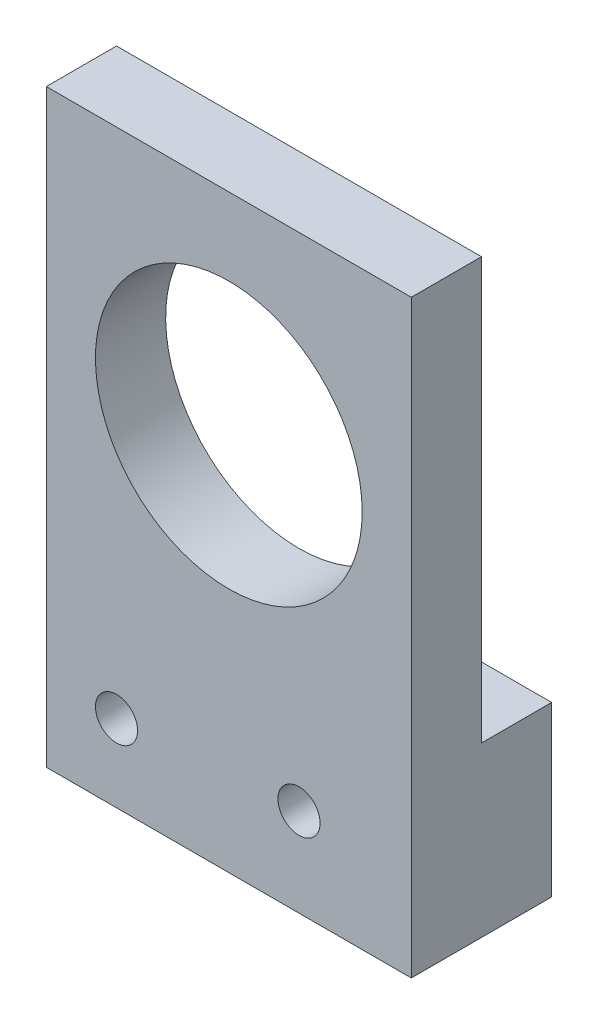
ISO-10303-21;
HEADER;
FILE_DESCRIPTION(('STEP AP214'),'2;1');
FILE_NAME('part.step','',(''),(''),'','','');
FILE_SCHEMA(('AUTOMOTIVE_DESIGN { 1 0 10303 214 1 1 1 1 }'));
ENDSEC;
DATA;
#1=APPLICATION_CONTEXT('core data for automotive mechanical design processes');
#2=APPLICATION_PROTOCOL_DEFINITION('international standard','automotive_design',2000,#1);
#3=PRODUCT_CONTEXT('',#1,'mechanical');
#4=PRODUCT('Part','Part','',(#3));
#5=PRODUCT_RELATED_PRODUCT_CATEGORY('part','',(#4));
#6=PRODUCT_DEFINITION_FORMATION('','',#4);
#7=PRODUCT_DEFINITION_CONTEXT('part definition',#1,'design');
#8=PRODUCT_DEFINITION('design','',#6,#7);
#9=PRODUCT_DEFINITION_SHAPE('','',#8);
#10=(LENGTH_UNIT() NAMED_UNIT(*) SI_UNIT(.MILLI.,.METRE.));
#11=(NAMED_UNIT(*) PLANE_ANGLE_UNIT() SI_UNIT($,.RADIAN.));
#12=(NAMED_UNIT(*) SI_UNIT($,.STERADIAN.) SOLID_ANGLE_UNIT());
#13=UNCERTAINTY_MEASURE_WITH_UNIT(LENGTH_MEASURE(1.E-05),#10,'distance_accuracy_value','');
#14=(GEOMETRIC_REPRESENTATION_CONTEXT(3) GLOBAL_UNCERTAINTY_ASSIGNED_CONTEXT((#13)) GLOBAL_UNIT_ASSIGNED_CONTEXT((#10,
#11,#12)) REPRESENTATION_CONTEXT('',''));
#15=CARTESIAN_POINT('',(0.,0.,0.));
#16=DIRECTION('',(0.,0.,1.));
#17=DIRECTION('',(1.,0.,0.));
#18=AXIS2_PLACEMENT_3D('',#15,#16,#17);
#19=CARTESIAN_POINT('',(0.,0.,10.));
#20=DIRECTION('',(0.,0.,-1.));
#21=DIRECTION('',(-1.,0.,0.));
#22=AXIS2_PLACEMENT_3D('',#19,#20,#21);
#23=PLANE('',#22);
#24=DIRECTION('',(1.,0.,0.));
#25=VECTOR('',#24,1.);
#26=CARTESIAN_POINT('',(13.,-27.,10.));
#27=LINE('',#26,#25);
#28=CARTESIAN_POINT('',(-13.,-27.,10.));
#29=VERTEX_POINT('',#28);
#30=CARTESIAN_POINT('',(13.,-27.,10.));
#31=VERTEX_POINT('',#30);
#32=EDGE_CURVE('E135',#29,#31,#27,.T.);
#33=ORIENTED_EDGE('',*,*,#32,.T.);
#34=DIRECTION('',(0.,1.,0.));
#35=VECTOR('',#34,1.);
#36=CARTESIAN_POINT('',(13.,15.,10.));
#37=LINE('',#36,#35);
#38=CARTESIAN_POINT('',(13.,15.,10.));
#39=VERTEX_POINT('',#38);
#40=EDGE_CURVE('E79',#31,#39,#37,.T.);
#41=ORIENTED_EDGE('',*,*,#40,.T.);
#42=DIRECTION('',(-1.,0.,0.));
#43=VECTOR('',#42,1.);
#44=CARTESIAN_POINT('',(-13.,15.,10.));
#45=LINE('',#44,#43);
#46=CARTESIAN_POINT('',(-13.,15.,10.));
#47=VERTEX_POINT('',#46);
#48=EDGE_CURVE('E138',#39,#47,#45,.T.);
#49=ORIENTED_EDGE('',*,*,#48,.T.);
#50=DIRECTION('',(0.,-1.,0.));
#51=VECTOR('',#50,1.);
#52=CARTESIAN_POINT('',(-13.,-27.,10.));
#53=LINE('',#52,#51);
#54=EDGE_CURVE('E58',#47,#29,#53,.T.);
#55=ORIENTED_EDGE('',*,*,#54,.T.);
#56=EDGE_LOOP('',(#33,#41,#49,#55));
#57=FACE_BOUND('',#56,.T.);
#58=CARTESIAN_POINT('',(0.,0.,10.));
#59=DIRECTION('',(0.,0.,1.));
#60=DIRECTION('',(1.,0.,0.));
#61=AXIS2_PLACEMENT_3D('',#58,#59,#60);
#62=CIRCLE('',#61,9.5);
#63=CARTESIAN_POINT('',(9.5,0.,10.));
#64=VERTEX_POINT('',#63);
#65=EDGE_CURVE('E129',#64,#64,#62,.T.);
#66=ORIENTED_EDGE('',*,*,#65,.F.);
#67=EDGE_LOOP('',(#66));
#68=FACE_BOUND('',#67,.T.);
#69=CARTESIAN_POINT('',(-8.,-21.5,10.));
#70=DIRECTION('',(0.,0.,1.));
#71=DIRECTION('',(1.,0.,0.));
#72=AXIS2_PLACEMENT_3D('',#69,#70,#71);
#73=CIRCLE('',#72,1.5);
#74=CARTESIAN_POINT('',(-6.5,-21.5,10.));
#75=VERTEX_POINT('',#74);
#76=EDGE_CURVE('E126',#75,#75,#73,.T.);
#77=ORIENTED_EDGE('',*,*,#76,.F.);
#78=EDGE_LOOP('',(#77));
#79=FACE_BOUND('',#78,.T.);
#80=CARTESIAN_POINT('',(5.,-20.7,10.));
#81=DIRECTION('',(0.,0.,1.));
#82=DIRECTION('',(-1.,0.,0.));
#83=AXIS2_PLACEMENT_3D('',#80,#81,#82);
#84=CIRCLE('',#83,1.5);
#85=CARTESIAN_POINT('',(3.5,-20.7,10.));
#86=VERTEX_POINT('',#85);
#87=EDGE_CURVE('E120',#86,#86,#84,.T.);
#88=ORIENTED_EDGE('',*,*,#87,.F.);
#89=EDGE_LOOP('',(#88));
#90=FACE_BOUND('',#89,.T.);
#91=ADVANCED_FACE('F33',(#57,#68,#79,#90),#23,.F.);
#92=CARTESIAN_POINT('',(0.,0.,0.));
#93=DIRECTION('',(0.,0.,-1.));
#94=DIRECTION('',(-1.,0.,0.));
#95=AXIS2_PLACEMENT_3D('',#92,#93,#94);
#96=PLANE('',#95);
#97=DIRECTION('',(-1.,0.,0.));
#98=VECTOR('',#97,1.);
#99=CARTESIAN_POINT('',(27.,-15.,0.));
#100=LINE('',#99,#98);
#101=CARTESIAN_POINT('',(13.,-15.,0.));
#102=VERTEX_POINT('',#101);
#103=CARTESIAN_POINT('',(-13.,-15.,0.));
#104=VERTEX_POINT('',#103);
#105=EDGE_CURVE('E49',#102,#104,#100,.T.);
#106=ORIENTED_EDGE('',*,*,#105,.F.);
#107=DIRECTION('',(0.,1.,0.));
#108=VECTOR('',#107,1.);
#109=CARTESIAN_POINT('',(13.,15.,0.));
#110=LINE('',#109,#108);
#111=CARTESIAN_POINT('',(13.,-27.,0.));
#112=VERTEX_POINT('',#111);
#113=EDGE_CURVE('E144',#112,#102,#110,.T.);
#114=ORIENTED_EDGE('',*,*,#113,.F.);
#115=DIRECTION('',(1.,0.,0.));
#116=VECTOR('',#115,1.);
#117=CARTESIAN_POINT('',(13.,-27.,0.));
#118=LINE('',#117,#116);
#119=CARTESIAN_POINT('',(-13.,-27.,0.));
#120=VERTEX_POINT('',#119);
#121=EDGE_CURVE('E134',#120,#112,#118,.T.);
#122=ORIENTED_EDGE('',*,*,#121,.F.);
#123=DIRECTION('',(0.,-1.,0.));
#124=VECTOR('',#123,1.);
#125=CARTESIAN_POINT('',(-13.,-27.,0.));
#126=LINE('',#125,#124);
#127=EDGE_CURVE('E72',#104,#120,#126,.T.);
#128=ORIENTED_EDGE('',*,*,#127,.F.);
#129=EDGE_LOOP('',(#106,#114,#122,#128));
#130=FACE_BOUND('',#129,.T.);
#131=CARTESIAN_POINT('',(-8.,-21.5,0.));
#132=DIRECTION('',(0.,0.,1.));
#133=DIRECTION('',(1.,0.,0.));
#134=AXIS2_PLACEMENT_3D('',#131,#132,#133);
#135=CIRCLE('',#134,1.5);
#136=CARTESIAN_POINT('',(-6.5,-21.5,0.));
#137=VERTEX_POINT('',#136);
#138=EDGE_CURVE('E123',#137,#137,#135,.T.);
#139=ORIENTED_EDGE('',*,*,#138,.T.);
#140=EDGE_LOOP('',(#139));
#141=FACE_BOUND('',#140,.T.);
#142=CARTESIAN_POINT('',(5.,-20.7,0.));
#143=DIRECTION('',(0.,0.,1.));
#144=DIRECTION('',(-1.,0.,0.));
#145=AXIS2_PLACEMENT_3D('',#142,#143,#144);
#146=CIRCLE('',#145,1.5);
#147=CARTESIAN_POINT('',(3.5,-20.7,0.));
#148=VERTEX_POINT('',#147);
#149=EDGE_CURVE('E119',#148,#148,#146,.T.);
#150=ORIENTED_EDGE('',*,*,#149,.T.);
#151=EDGE_LOOP('',(#150));
#152=FACE_BOUND('',#151,.T.);
#153=ADVANCED_FACE('F156',(#130,#141,#152),#96,.T.);
#154=CARTESIAN_POINT('',(13.,-27.,10.));
#155=DIRECTION('',(0.,1.,0.));
#156=DIRECTION('',(-1.,0.,0.));
#157=AXIS2_PLACEMENT_3D('',#154,#155,#156);
#158=PLANE('',#157);
#159=ORIENTED_EDGE('',*,*,#121,.T.);
#160=DIRECTION('',(0.,0.,-1.));
#161=VECTOR('',#160,1.);
#162=CARTESIAN_POINT('',(13.,-27.,10.));
#163=LINE('',#162,#161);
#164=EDGE_CURVE('E11',#31,#112,#163,.T.);
#165=ORIENTED_EDGE('',*,*,#164,.F.);
#166=ORIENTED_EDGE('',*,*,#32,.F.);
#167=DIRECTION('',(0.,0.,-1.));
#168=VECTOR('',#167,1.);
#169=CARTESIAN_POINT('',(-13.,-27.,10.));
#170=LINE('',#169,#168);
#171=EDGE_CURVE('E141',#29,#120,#170,.T.);
#172=ORIENTED_EDGE('',*,*,#171,.T.);
#173=EDGE_LOOP('',(#159,#165,#166,#172));
#174=FACE_BOUND('',#173,.T.);
#175=ADVANCED_FACE('F35',(#174),#158,.F.);
#176=CARTESIAN_POINT('',(13.,15.,10.));
#177=DIRECTION('',(-1.,0.,0.));
#178=DIRECTION('',(0.,-1.,0.));
#179=AXIS2_PLACEMENT_3D('',#176,#177,#178);
#180=PLANE('',#179);
#181=DIRECTION('',(0.,0.,1.));
#182=VECTOR('',#181,1.);
#183=CARTESIAN_POINT('',(13.,-15.,10.));
#184=LINE('',#183,#182);
#185=CARTESIAN_POINT('',(13.,-15.,5.));
#186=VERTEX_POINT('',#185);
#187=EDGE_CURVE('E117',#102,#186,#184,.T.);
#188=ORIENTED_EDGE('',*,*,#187,.T.);
#189=DIRECTION('',(0.,1.,0.));
#190=VECTOR('',#189,1.);
#191=CARTESIAN_POINT('',(13.,15.,5.));
#192=LINE('',#191,#190);
#193=CARTESIAN_POINT('',(13.,15.,5.));
#194=VERTEX_POINT('',#193);
#195=EDGE_CURVE('E101',#186,#194,#192,.T.);
#196=ORIENTED_EDGE('',*,*,#195,.T.);
#197=DIRECTION('',(0.,0.,-1.));
#198=VECTOR('',#197,1.);
#199=CARTESIAN_POINT('',(13.,15.,10.));
#200=LINE('',#199,#198);
#201=EDGE_CURVE('E42',#39,#194,#200,.T.);
#202=ORIENTED_EDGE('',*,*,#201,.F.);
#203=ORIENTED_EDGE('',*,*,#40,.F.);
#204=ORIENTED_EDGE('',*,*,#164,.T.);
#205=ORIENTED_EDGE('',*,*,#113,.T.);
#206=EDGE_LOOP('',(#188,#196,#202,#203,#204,#205));
#207=FACE_BOUND('',#206,.T.);
#208=ADVANCED_FACE('F154',(#207),#180,.F.);
#209=CARTESIAN_POINT('',(-13.,15.,10.));
#210=DIRECTION('',(0.,-1.,0.));
#211=DIRECTION('',(0.,0.,-1.));
#212=AXIS2_PLACEMENT_3D('',#209,#210,#211);
#213=PLANE('',#212);
#214=ORIENTED_EDGE('',*,*,#201,.T.);
#215=DIRECTION('',(-1.,0.,0.));
#216=VECTOR('',#215,1.);
#217=CARTESIAN_POINT('',(27.,15.,5.));
#218=LINE('',#217,#216);
#219=CARTESIAN_POINT('',(-13.,15.,5.));
#220=VERTEX_POINT('',#219);
#221=EDGE_CURVE('E103',#194,#220,#218,.T.);
#222=ORIENTED_EDGE('',*,*,#221,.T.);
#223=DIRECTION('',(0.,0.,-1.));
#224=VECTOR('',#223,1.);
#225=CARTESIAN_POINT('',(-13.,15.,10.));
#226=LINE('',#225,#224);
#227=EDGE_CURVE('E111',#47,#220,#226,.T.);
#228=ORIENTED_EDGE('',*,*,#227,.F.);
#229=ORIENTED_EDGE('',*,*,#48,.F.);
#230=EDGE_LOOP('',(#214,#222,#228,#229));
#231=FACE_BOUND('',#230,.T.);
#232=ADVANCED_FACE('F153',(#231),#213,.F.);
#233=CARTESIAN_POINT('',(-13.,-27.,10.));
#234=DIRECTION('',(1.,0.,0.));
#235=DIRECTION('',(0.,1.,0.));
#236=AXIS2_PLACEMENT_3D('',#233,#234,#235);
#237=PLANE('',#236);
#238=ORIENTED_EDGE('',*,*,#227,.T.);
#239=DIRECTION('',(0.,1.,0.));
#240=VECTOR('',#239,1.);
#241=CARTESIAN_POINT('',(-13.,15.,5.));
#242=LINE('',#241,#240);
#243=CARTESIAN_POINT('',(-13.,-15.,5.));
#244=VERTEX_POINT('',#243);
#245=EDGE_CURVE('E98',#244,#220,#242,.T.);
#246=ORIENTED_EDGE('',*,*,#245,.F.);
#247=DIRECTION('',(0.,0.,1.));
#248=VECTOR('',#247,1.);
#249=CARTESIAN_POINT('',(-13.,-15.,5.));
#250=LINE('',#249,#248);
#251=EDGE_CURVE('E105',#104,#244,#250,.T.);
#252=ORIENTED_EDGE('',*,*,#251,.F.);
#253=ORIENTED_EDGE('',*,*,#127,.T.);
#254=ORIENTED_EDGE('',*,*,#171,.F.);
#255=ORIENTED_EDGE('',*,*,#54,.F.);
#256=EDGE_LOOP('',(#238,#246,#252,#253,#254,#255));
#257=FACE_BOUND('',#256,.T.);
#258=ADVANCED_FACE('F109',(#257),#237,.F.);
#259=CARTESIAN_POINT('',(0.,0.,10.));
#260=DIRECTION('',(0.,0.,-1.));
#261=DIRECTION('',(-1.,0.,0.));
#262=AXIS2_PLACEMENT_3D('',#259,#260,#261);
#263=CYLINDRICAL_SURFACE('',#262,9.5);
#264=CARTESIAN_POINT('',(0.,0.,5.));
#265=DIRECTION('',(0.,0.,1.));
#266=DIRECTION('',(0.,-1.,0.));
#267=AXIS2_PLACEMENT_3D('',#264,#265,#266);
#268=CIRCLE('',#267,9.5);
#269=CARTESIAN_POINT('',(0.,-9.5,5.));
#270=VERTEX_POINT('',#269);
#271=EDGE_CURVE('E37',#270,#270,#268,.T.);
#272=ORIENTED_EDGE('',*,*,#271,.F.);
#273=EDGE_LOOP('',(#272));
#274=FACE_BOUND('',#273,.T.);
#275=ORIENTED_EDGE('',*,*,#65,.T.);
#276=EDGE_LOOP('',(#275));
#277=FACE_BOUND('',#276,.T.);
#278=ADVANCED_FACE('F187',(#274,#277),#263,.F.);
#279=CARTESIAN_POINT('',(-8.,-21.5,10.));
#280=DIRECTION('',(0.,0.,-1.));
#281=DIRECTION('',(-1.,0.,0.));
#282=AXIS2_PLACEMENT_3D('',#279,#280,#281);
#283=CYLINDRICAL_SURFACE('',#282,1.5);
#284=ORIENTED_EDGE('',*,*,#76,.T.);
#285=EDGE_LOOP('',(#284));
#286=FACE_BOUND('',#285,.T.);
#287=ORIENTED_EDGE('',*,*,#138,.F.);
#288=EDGE_LOOP('',(#287));
#289=FACE_BOUND('',#288,.T.);
#290=ADVANCED_FACE('F174',(#286,#289),#283,.F.);
#291=CARTESIAN_POINT('',(5.,-20.7,10.));
#292=DIRECTION('',(0.,0.,-1.));
#293=DIRECTION('',(-1.,0.,0.));
#294=AXIS2_PLACEMENT_3D('',#291,#292,#293);
#295=CYLINDRICAL_SURFACE('',#294,1.5);
#296=ORIENTED_EDGE('',*,*,#87,.T.);
#297=EDGE_LOOP('',(#296));
#298=FACE_BOUND('',#297,.T.);
#299=ORIENTED_EDGE('',*,*,#149,.F.);
#300=EDGE_LOOP('',(#299));
#301=FACE_BOUND('',#300,.T.);
#302=ADVANCED_FACE('F171',(#298,#301),#295,.F.);
#303=CARTESIAN_POINT('',(27.,-15.,5.));
#304=DIRECTION('',(0.,-1.,0.));
#305=DIRECTION('',(0.,0.,-1.));
#306=AXIS2_PLACEMENT_3D('',#303,#304,#305);
#307=PLANE('',#306);
#308=ORIENTED_EDGE('',*,*,#105,.T.);
#309=ORIENTED_EDGE('',*,*,#251,.T.);
#310=DIRECTION('',(-1.,0.,0.));
#311=VECTOR('',#310,1.);
#312=CARTESIAN_POINT('',(27.,-15.,5.));
#313=LINE('',#312,#311);
#314=EDGE_CURVE('E95',#186,#244,#313,.T.);
#315=ORIENTED_EDGE('',*,*,#314,.F.);
#316=ORIENTED_EDGE('',*,*,#187,.F.);
#317=EDGE_LOOP('',(#308,#309,#315,#316));
#318=FACE_BOUND('',#317,.T.);
#319=ADVANCED_FACE('F106',(#318),#307,.F.);
#320=CARTESIAN_POINT('',(27.,15.,5.));
#321=DIRECTION('',(0.,0.,1.));
#322=DIRECTION('',(0.,-1.,0.));
#323=AXIS2_PLACEMENT_3D('',#320,#321,#322);
#324=PLANE('',#323);
#325=ORIENTED_EDGE('',*,*,#271,.T.);
#326=EDGE_LOOP('',(#325));
#327=FACE_BOUND('',#326,.T.);
#328=ORIENTED_EDGE('',*,*,#314,.T.);
#329=ORIENTED_EDGE('',*,*,#245,.T.);
#330=ORIENTED_EDGE('',*,*,#221,.F.);
#331=ORIENTED_EDGE('',*,*,#195,.F.);
#332=EDGE_LOOP('',(#328,#329,#330,#331));
#333=FACE_BOUND('',#332,.T.);
#334=ADVANCED_FACE('F96',(#327,#333),#324,.F.);
#335=CLOSED_SHELL('',(#91,#153,#175,#208,#232,#258,#278,#290,#302,#319,#334));
#336=MANIFOLD_SOLID_BREP('B2',#335);
#337=ADVANCED_BREP_SHAPE_REPRESENTATION('',(#18,#336),#14);
#338=SHAPE_DEFINITION_REPRESENTATION(#9,#337);
ENDSEC;
END-ISO-10303-21;
